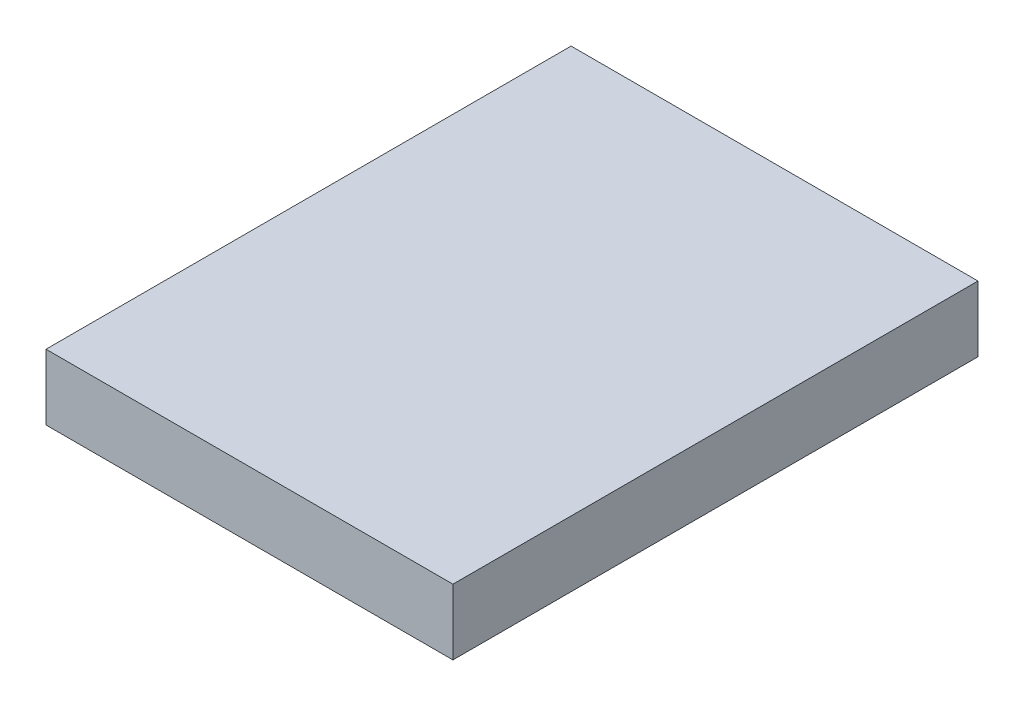
ISO-10303-21;
HEADER;
FILE_DESCRIPTION(('STEP AP214'),'2;1');
FILE_NAME('part.step','',(''),(''),'','','');
FILE_SCHEMA(('AUTOMOTIVE_DESIGN { 1 0 10303 214 1 1 1 1 }'));
ENDSEC;
DATA;
#1=APPLICATION_CONTEXT('core data for automotive mechanical design processes');
#2=APPLICATION_PROTOCOL_DEFINITION('international standard','automotive_design',2000,#1);
#3=PRODUCT_CONTEXT('',#1,'mechanical');
#4=PRODUCT('Part','Part','',(#3));
#5=PRODUCT_RELATED_PRODUCT_CATEGORY('part','',(#4));
#6=PRODUCT_DEFINITION_FORMATION('','',#4);
#7=PRODUCT_DEFINITION_CONTEXT('part definition',#1,'design');
#8=PRODUCT_DEFINITION('design','',#6,#7);
#9=PRODUCT_DEFINITION_SHAPE('','',#8);
#10=(LENGTH_UNIT() NAMED_UNIT(*) SI_UNIT(.MILLI.,.METRE.));
#11=(NAMED_UNIT(*) PLANE_ANGLE_UNIT() SI_UNIT($,.RADIAN.));
#12=(NAMED_UNIT(*) SI_UNIT($,.STERADIAN.) SOLID_ANGLE_UNIT());
#13=UNCERTAINTY_MEASURE_WITH_UNIT(LENGTH_MEASURE(1.E-05),#10,'distance_accuracy_value','');
#14=(GEOMETRIC_REPRESENTATION_CONTEXT(3) GLOBAL_UNCERTAINTY_ASSIGNED_CONTEXT((#13)) GLOBAL_UNIT_ASSIGNED_CONTEXT((#10,
#11,#12)) REPRESENTATION_CONTEXT('',''));
#15=CARTESIAN_POINT('',(0.,0.,0.));
#16=DIRECTION('',(0.,0.,1.));
#17=DIRECTION('',(1.,0.,0.));
#18=AXIS2_PLACEMENT_3D('',#15,#16,#17);
#19=CARTESIAN_POINT('',(15.5,5.,20.));
#20=DIRECTION('',(-1.,0.,0.));
#21=DIRECTION('',(0.,0.,1.));
#22=AXIS2_PLACEMENT_3D('',#19,#20,#21);
#23=PLANE('',#22);
#24=DIRECTION('',(0.,0.,-1.));
#25=VECTOR('',#24,1.);
#26=CARTESIAN_POINT('',(15.5,0.,20.));
#27=LINE('',#26,#25);
#28=CARTESIAN_POINT('',(15.5,0.,20.));
#29=VERTEX_POINT('',#28);
#30=CARTESIAN_POINT('',(15.5,0.,-20.));
#31=VERTEX_POINT('',#30);
#32=EDGE_CURVE('E111',#29,#31,#27,.T.);
#33=ORIENTED_EDGE('',*,*,#32,.T.);
#34=DIRECTION('',(0.,-1.,0.));
#35=VECTOR('',#34,1.);
#36=CARTESIAN_POINT('',(15.5,5.,-20.));
#37=LINE('',#36,#35);
#38=CARTESIAN_POINT('',(15.5,5.,-20.));
#39=VERTEX_POINT('',#38);
#40=EDGE_CURVE('E11',#39,#31,#37,.T.);
#41=ORIENTED_EDGE('',*,*,#40,.F.);
#42=DIRECTION('',(0.,0.,-1.));
#43=VECTOR('',#42,1.);
#44=CARTESIAN_POINT('',(15.5,5.,20.));
#45=LINE('',#44,#43);
#46=CARTESIAN_POINT('',(15.5,5.,20.));
#47=VERTEX_POINT('',#46);
#48=EDGE_CURVE('E95',#47,#39,#45,.T.);
#49=ORIENTED_EDGE('',*,*,#48,.F.);
#50=DIRECTION('',(0.,-1.,0.));
#51=VECTOR('',#50,1.);
#52=CARTESIAN_POINT('',(15.5,5.,20.));
#53=LINE('',#52,#51);
#54=EDGE_CURVE('E107',#47,#29,#53,.T.);
#55=ORIENTED_EDGE('',*,*,#54,.T.);
#56=EDGE_LOOP('',(#33,#41,#49,#55));
#57=FACE_BOUND('',#56,.T.);
#58=ADVANCED_FACE('F43',(#57),#23,.F.);
#59=CARTESIAN_POINT('',(-15.5,5.,-20.));
#60=DIRECTION('',(0.,0.,1.));
#61=DIRECTION('',(1.,0.,0.));
#62=AXIS2_PLACEMENT_3D('',#59,#60,#61);
#63=PLANE('',#62);
#64=DIRECTION('',(-1.,0.,0.));
#65=VECTOR('',#64,1.);
#66=CARTESIAN_POINT('',(-15.5,0.,-20.));
#67=LINE('',#66,#65);
#68=CARTESIAN_POINT('',(-15.5,0.,-20.));
#69=VERTEX_POINT('',#68);
#70=EDGE_CURVE('E100',#31,#69,#67,.T.);
#71=ORIENTED_EDGE('',*,*,#70,.T.);
#72=DIRECTION('',(0.,-1.,0.));
#73=VECTOR('',#72,1.);
#74=CARTESIAN_POINT('',(-15.5,5.,-20.));
#75=LINE('',#74,#73);
#76=CARTESIAN_POINT('',(-15.5,5.,-20.));
#77=VERTEX_POINT('',#76);
#78=EDGE_CURVE('E52',#77,#69,#75,.T.);
#79=ORIENTED_EDGE('',*,*,#78,.F.);
#80=DIRECTION('',(-1.,0.,0.));
#81=VECTOR('',#80,1.);
#82=CARTESIAN_POINT('',(-15.5,5.,-20.));
#83=LINE('',#82,#81);
#84=EDGE_CURVE('E90',#39,#77,#83,.T.);
#85=ORIENTED_EDGE('',*,*,#84,.F.);
#86=ORIENTED_EDGE('',*,*,#40,.T.);
#87=EDGE_LOOP('',(#71,#79,#85,#86));
#88=FACE_BOUND('',#87,.T.);
#89=ADVANCED_FACE('F99',(#88),#63,.F.);
#90=CARTESIAN_POINT('',(-15.5,5.,20.));
#91=DIRECTION('',(1.,0.,0.));
#92=DIRECTION('',(0.,0.,-1.));
#93=AXIS2_PLACEMENT_3D('',#90,#91,#92);
#94=PLANE('',#93);
#95=DIRECTION('',(0.,0.,1.));
#96=VECTOR('',#95,1.);
#97=CARTESIAN_POINT('',(-15.5,0.,20.));
#98=LINE('',#97,#96);
#99=CARTESIAN_POINT('',(-15.5,0.,20.));
#100=VERTEX_POINT('',#99);
#101=EDGE_CURVE('E77',#69,#100,#98,.T.);
#102=ORIENTED_EDGE('',*,*,#101,.T.);
#103=DIRECTION('',(0.,-1.,0.));
#104=VECTOR('',#103,1.);
#105=CARTESIAN_POINT('',(-15.5,5.,20.));
#106=LINE('',#105,#104);
#107=CARTESIAN_POINT('',(-15.5,5.,20.));
#108=VERTEX_POINT('',#107);
#109=EDGE_CURVE('E102',#108,#100,#106,.T.);
#110=ORIENTED_EDGE('',*,*,#109,.F.);
#111=DIRECTION('',(0.,0.,1.));
#112=VECTOR('',#111,1.);
#113=CARTESIAN_POINT('',(-15.5,5.,20.));
#114=LINE('',#113,#112);
#115=EDGE_CURVE('E93',#77,#108,#114,.T.);
#116=ORIENTED_EDGE('',*,*,#115,.F.);
#117=ORIENTED_EDGE('',*,*,#78,.T.);
#118=EDGE_LOOP('',(#102,#110,#116,#117));
#119=FACE_BOUND('',#118,.T.);
#120=ADVANCED_FACE('F103',(#119),#94,.F.);
#121=CARTESIAN_POINT('',(-15.5,5.,20.));
#122=DIRECTION('',(0.,0.,-1.));
#123=DIRECTION('',(-1.,0.,0.));
#124=AXIS2_PLACEMENT_3D('',#121,#122,#123);
#125=PLANE('',#124);
#126=DIRECTION('',(1.,0.,0.));
#127=VECTOR('',#126,1.);
#128=CARTESIAN_POINT('',(-15.5,0.,20.));
#129=LINE('',#128,#127);
#130=EDGE_CURVE('E83',#100,#29,#129,.T.);
#131=ORIENTED_EDGE('',*,*,#130,.T.);
#132=ORIENTED_EDGE('',*,*,#54,.F.);
#133=DIRECTION('',(1.,0.,0.));
#134=VECTOR('',#133,1.);
#135=CARTESIAN_POINT('',(-15.5,5.,20.));
#136=LINE('',#135,#134);
#137=EDGE_CURVE('E60',#108,#47,#136,.T.);
#138=ORIENTED_EDGE('',*,*,#137,.F.);
#139=ORIENTED_EDGE('',*,*,#109,.T.);
#140=EDGE_LOOP('',(#131,#132,#138,#139));
#141=FACE_BOUND('',#140,.T.);
#142=ADVANCED_FACE('F124',(#141),#125,.F.);
#143=CARTESIAN_POINT('',(0.,5.,0.));
#144=DIRECTION('',(0.,-1.,0.));
#145=DIRECTION('',(0.,0.,-1.));
#146=AXIS2_PLACEMENT_3D('',#143,#144,#145);
#147=PLANE('',#146);
#148=ORIENTED_EDGE('',*,*,#48,.T.);
#149=ORIENTED_EDGE('',*,*,#84,.T.);
#150=ORIENTED_EDGE('',*,*,#115,.T.);
#151=ORIENTED_EDGE('',*,*,#137,.T.);
#152=EDGE_LOOP('',(#148,#149,#150,#151));
#153=FACE_BOUND('',#152,.T.);
#154=ADVANCED_FACE('F91',(#153),#147,.F.);
#155=CARTESIAN_POINT('',(0.,0.,0.));
#156=DIRECTION('',(0.,-1.,0.));
#157=DIRECTION('',(0.,0.,-1.));
#158=AXIS2_PLACEMENT_3D('',#155,#156,#157);
#159=PLANE('',#158);
#160=ORIENTED_EDGE('',*,*,#32,.F.);
#161=ORIENTED_EDGE('',*,*,#130,.F.);
#162=ORIENTED_EDGE('',*,*,#101,.F.);
#163=ORIENTED_EDGE('',*,*,#70,.F.);
#164=EDGE_LOOP('',(#160,#161,#162,#163));
#165=FACE_BOUND('',#164,.T.);
#166=ADVANCED_FACE('F127',(#165),#159,.T.);
#167=CLOSED_SHELL('',(#58,#89,#120,#142,#154,#166));
#168=MANIFOLD_SOLID_BREP('B2',#167);
#169=ADVANCED_BREP_SHAPE_REPRESENTATION('',(#18,#168),#14);
#170=SHAPE_DEFINITION_REPRESENTATION(#9,#169);
ENDSEC;
END-ISO-10303-21;
